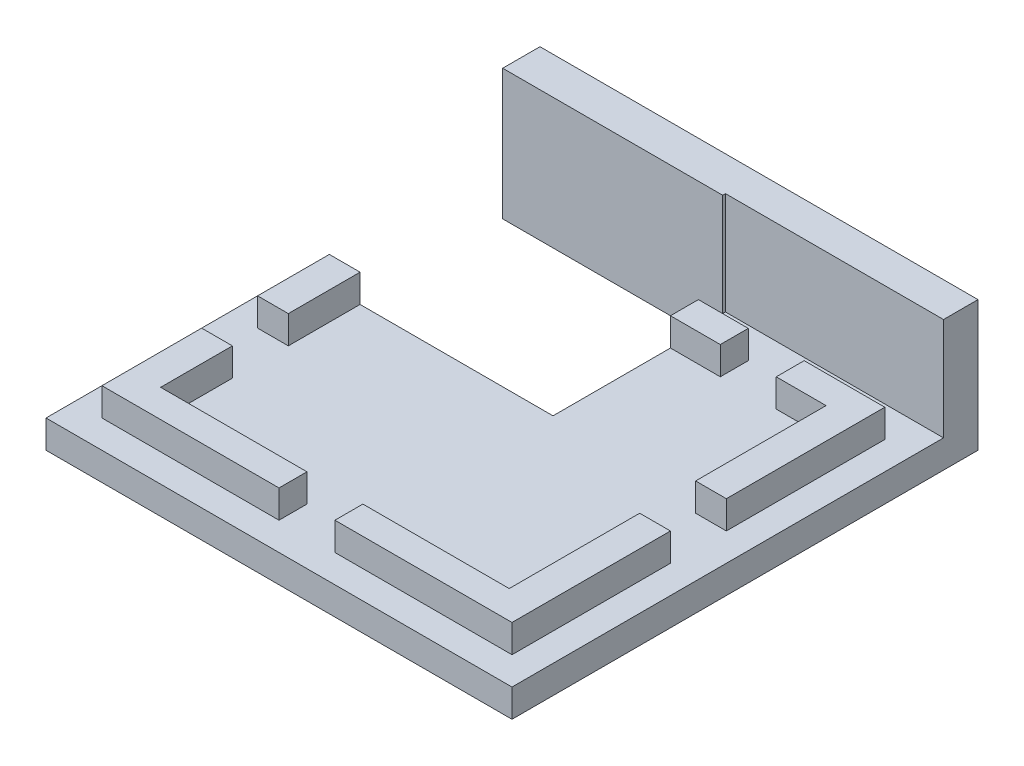
ISO-10303-21;
HEADER;
FILE_DESCRIPTION(('STEP AP214'),'2;1');
FILE_NAME('part.step','',(''),(''),'','','');
FILE_SCHEMA(('AUTOMOTIVE_DESIGN { 1 0 10303 214 1 1 1 1 }'));
ENDSEC;
DATA;
#1=APPLICATION_CONTEXT('core data for automotive mechanical design processes');
#2=APPLICATION_PROTOCOL_DEFINITION('international standard','automotive_design',2000,#1);
#3=PRODUCT_CONTEXT('',#1,'mechanical');
#4=PRODUCT('Part','Part','',(#3));
#5=PRODUCT_RELATED_PRODUCT_CATEGORY('part','',(#4));
#6=PRODUCT_DEFINITION_FORMATION('','',#4);
#7=PRODUCT_DEFINITION_CONTEXT('part definition',#1,'design');
#8=PRODUCT_DEFINITION('design','',#6,#7);
#9=PRODUCT_DEFINITION_SHAPE('','',#8);
#10=(LENGTH_UNIT() NAMED_UNIT(*) SI_UNIT(.MILLI.,.METRE.));
#11=(NAMED_UNIT(*) PLANE_ANGLE_UNIT() SI_UNIT($,.RADIAN.));
#12=(NAMED_UNIT(*) SI_UNIT($,.STERADIAN.) SOLID_ANGLE_UNIT());
#13=UNCERTAINTY_MEASURE_WITH_UNIT(LENGTH_MEASURE(1.E-05),#10,'distance_accuracy_value','');
#14=(GEOMETRIC_REPRESENTATION_CONTEXT(3) GLOBAL_UNCERTAINTY_ASSIGNED_CONTEXT((#13)) GLOBAL_UNIT_ASSIGNED_CONTEXT((#10,
#11,#12)) REPRESENTATION_CONTEXT('',''));
#15=CARTESIAN_POINT('',(0.,0.,0.));
#16=DIRECTION('',(0.,0.,1.));
#17=DIRECTION('',(1.,0.,0.));
#18=AXIS2_PLACEMENT_3D('',#15,#16,#17);
#19=CARTESIAN_POINT('',(-11.,3.,-10.));
#20=DIRECTION('',(0.,0.,1.));
#21=DIRECTION('',(1.,0.,0.));
#22=AXIS2_PLACEMENT_3D('',#19,#20,#21);
#23=PLANE('',#22);
#24=DIRECTION('',(-1.,0.,0.));
#25=VECTOR('',#24,1.);
#26=CARTESIAN_POINT('',(-11.,1.5,-10.));
#27=LINE('',#26,#25);
#28=CARTESIAN_POINT('',(11.,1.5,-10.));
#29=VERTEX_POINT('',#28);
#30=CARTESIAN_POINT('',(6.675,1.5,-10.));
#31=VERTEX_POINT('',#30);
#32=EDGE_CURVE('E497',#29,#31,#27,.T.);
#33=ORIENTED_EDGE('',*,*,#32,.T.);
#34=DIRECTION('',(0.,1.,0.));
#35=VECTOR('',#34,1.);
#36=CARTESIAN_POINT('',(6.675,-1.923813663154,-10.));
#37=LINE('',#36,#35);
#38=CARTESIAN_POINT('',(6.675,3.,-10.));
#39=VERTEX_POINT('',#38);
#40=EDGE_CURVE('E395',#31,#39,#37,.T.);
#41=ORIENTED_EDGE('',*,*,#40,.T.);
#42=DIRECTION('',(-1.,0.,0.));
#43=VECTOR('',#42,1.);
#44=CARTESIAN_POINT('',(-11.,3.,-10.));
#45=LINE('',#44,#43);
#46=CARTESIAN_POINT('',(11.,3.,-10.));
#47=VERTEX_POINT('',#46);
#48=EDGE_CURVE('E481',#47,#39,#45,.T.);
#49=ORIENTED_EDGE('',*,*,#48,.F.);
#50=DIRECTION('',(0.,-1.,0.));
#51=VECTOR('',#50,1.);
#52=CARTESIAN_POINT('',(11.,3.,-10.));
#53=LINE('',#52,#51);
#54=EDGE_CURVE('E513',#47,#29,#53,.T.);
#55=ORIENTED_EDGE('',*,*,#54,.T.);
#56=EDGE_LOOP('',(#33,#41,#49,#55));
#57=FACE_BOUND('',#56,.T.);
#58=ADVANCED_FACE('F33',(#57),#23,.F.);
#59=CARTESIAN_POINT('',(-9.35,3.,-8.5));
#60=DIRECTION('',(0.,0.,1.));
#61=DIRECTION('',(1.,0.,0.));
#62=AXIS2_PLACEMENT_3D('',#59,#60,#61);
#63=PLANE('',#62);
#64=DIRECTION('',(0.,1.,0.));
#65=VECTOR('',#64,1.);
#66=CARTESIAN_POINT('',(6.675,-1.923813663154,-8.5));
#67=LINE('',#66,#65);
#68=CARTESIAN_POINT('',(6.675,1.5,-8.5));
#69=VERTEX_POINT('',#68);
#70=CARTESIAN_POINT('',(6.675,3.,-8.5));
#71=VERTEX_POINT('',#70);
#72=EDGE_CURVE('E387',#69,#71,#67,.T.);
#73=ORIENTED_EDGE('',*,*,#72,.F.);
#74=DIRECTION('',(-1.,0.,0.));
#75=VECTOR('',#74,1.);
#76=CARTESIAN_POINT('',(-9.35,1.5,-8.5));
#77=LINE('',#76,#75);
#78=CARTESIAN_POINT('',(9.35,1.5,-8.5));
#79=VERTEX_POINT('',#78);
#80=EDGE_CURVE('E456',#79,#69,#77,.T.);
#81=ORIENTED_EDGE('',*,*,#80,.F.);
#82=DIRECTION('',(0.,-1.,0.));
#83=VECTOR('',#82,1.);
#84=CARTESIAN_POINT('',(9.35,3.,-8.5));
#85=LINE('',#84,#83);
#86=CARTESIAN_POINT('',(9.35,3.,-8.5));
#87=VERTEX_POINT('',#86);
#88=EDGE_CURVE('E472',#87,#79,#85,.T.);
#89=ORIENTED_EDGE('',*,*,#88,.F.);
#90=DIRECTION('',(-1.,0.,0.));
#91=VECTOR('',#90,1.);
#92=CARTESIAN_POINT('',(-9.35,3.,-8.5));
#93=LINE('',#92,#91);
#94=EDGE_CURVE('E440',#87,#71,#93,.T.);
#95=ORIENTED_EDGE('',*,*,#94,.T.);
#96=EDGE_LOOP('',(#73,#81,#89,#95));
#97=FACE_BOUND('',#96,.T.);
#98=ADVANCED_FACE('F603',(#97),#63,.T.);
#99=CARTESIAN_POINT('',(0.,3.,0.));
#100=DIRECTION('',(0.,-1.,0.));
#101=DIRECTION('',(0.,0.,-1.));
#102=AXIS2_PLACEMENT_3D('',#99,#100,#101);
#103=PLANE('',#102);
#104=DIRECTION('',(0.,0.,1.));
#105=VECTOR('',#104,1.);
#106=CARTESIAN_POINT('',(-9.35,3.,8.5));
#107=LINE('',#106,#105);
#108=CARTESIAN_POINT('',(-9.35,3.,4.65));
#109=VERTEX_POINT('',#108);
#110=CARTESIAN_POINT('',(-9.35,3.,8.5));
#111=VERTEX_POINT('',#110);
#112=EDGE_CURVE('E443',#109,#111,#107,.T.);
#113=ORIENTED_EDGE('',*,*,#112,.F.);
#114=DIRECTION('',(1.,0.,0.));
#115=VECTOR('',#114,1.);
#116=CARTESIAN_POINT('',(-11.,3.,4.65));
#117=LINE('',#116,#115);
#118=CARTESIAN_POINT('',(-11.,3.,4.65));
#119=VERTEX_POINT('',#118);
#120=EDGE_CURVE('E331',#119,#109,#117,.T.);
#121=ORIENTED_EDGE('',*,*,#120,.F.);
#122=DIRECTION('',(0.,0.,1.));
#123=VECTOR('',#122,1.);
#124=CARTESIAN_POINT('',(-11.,3.,10.));
#125=LINE('',#124,#123);
#126=CARTESIAN_POINT('',(-11.,3.,10.));
#127=VERTEX_POINT('',#126);
#128=EDGE_CURVE('E484',#119,#127,#125,.T.);
#129=ORIENTED_EDGE('',*,*,#128,.T.);
#130=DIRECTION('',(1.,0.,0.));
#131=VECTOR('',#130,1.);
#132=CARTESIAN_POINT('',(-11.,3.,10.));
#133=LINE('',#132,#131);
#134=CARTESIAN_POINT('',(-1.5,3.,10.));
#135=VERTEX_POINT('',#134);
#136=EDGE_CURVE('E489',#127,#135,#133,.T.);
#137=ORIENTED_EDGE('',*,*,#136,.T.);
#138=DIRECTION('',(0.,0.,1.));
#139=VECTOR('',#138,1.);
#140=CARTESIAN_POINT('',(-1.5,3.,8.5));
#141=LINE('',#140,#139);
#142=CARTESIAN_POINT('',(-1.5,3.,8.5));
#143=VERTEX_POINT('',#142);
#144=EDGE_CURVE('E352',#143,#135,#141,.T.);
#145=ORIENTED_EDGE('',*,*,#144,.F.);
#146=DIRECTION('',(1.,0.,0.));
#147=VECTOR('',#146,1.);
#148=CARTESIAN_POINT('',(-9.35,3.,8.5));
#149=LINE('',#148,#147);
#150=EDGE_CURVE('E448',#111,#143,#149,.T.);
#151=ORIENTED_EDGE('',*,*,#150,.F.);
#152=EDGE_LOOP('',(#113,#121,#129,#137,#145,#151));
#153=FACE_BOUND('',#152,.T.);
#154=ADVANCED_FACE('F609',(#153),#103,.F.);
#155=CARTESIAN_POINT('',(1.5,3.,8.5));
#156=VERTEX_POINT('',#155);
#157=CARTESIAN_POINT('',(9.35,3.,8.5));
#158=VERTEX_POINT('',#157);
#159=EDGE_CURVE('E447',#156,#158,#149,.T.);
#160=ORIENTED_EDGE('',*,*,#159,.F.);
#161=DIRECTION('',(0.,0.,-1.));
#162=VECTOR('',#161,1.);
#163=CARTESIAN_POINT('',(1.5,3.,8.5));
#164=LINE('',#163,#162);
#165=CARTESIAN_POINT('',(1.5,3.,10.));
#166=VERTEX_POINT('',#165);
#167=EDGE_CURVE('E349',#166,#156,#164,.T.);
#168=ORIENTED_EDGE('',*,*,#167,.F.);
#169=CARTESIAN_POINT('',(11.,3.,10.));
#170=VERTEX_POINT('',#169);
#171=EDGE_CURVE('E488',#166,#170,#133,.T.);
#172=ORIENTED_EDGE('',*,*,#171,.T.);
#173=DIRECTION('',(0.,0.,-1.));
#174=VECTOR('',#173,1.);
#175=CARTESIAN_POINT('',(11.,3.,10.));
#176=LINE('',#175,#174);
#177=CARTESIAN_POINT('',(11.,3.,1.5));
#178=VERTEX_POINT('',#177);
#179=EDGE_CURVE('E476',#170,#178,#176,.T.);
#180=ORIENTED_EDGE('',*,*,#179,.T.);
#181=DIRECTION('',(1.,0.,0.));
#182=VECTOR('',#181,1.);
#183=CARTESIAN_POINT('',(9.35,3.,1.5));
#184=LINE('',#183,#182);
#185=CARTESIAN_POINT('',(9.35,3.,1.5));
#186=VERTEX_POINT('',#185);
#187=EDGE_CURVE('E370',#186,#178,#184,.T.);
#188=ORIENTED_EDGE('',*,*,#187,.F.);
#189=DIRECTION('',(0.,0.,-1.));
#190=VECTOR('',#189,1.);
#191=CARTESIAN_POINT('',(9.35,3.,8.5));
#192=LINE('',#191,#190);
#193=EDGE_CURVE('E435',#158,#186,#192,.T.);
#194=ORIENTED_EDGE('',*,*,#193,.F.);
#195=EDGE_LOOP('',(#160,#168,#172,#180,#188,#194));
#196=FACE_BOUND('',#195,.T.);
#197=ADVANCED_FACE('F950',(#196),#103,.F.);
#198=CARTESIAN_POINT('',(-11.,3.,-2.2));
#199=VERTEX_POINT('',#198);
#200=CARTESIAN_POINT('',(-11.,3.,1.65));
#201=VERTEX_POINT('',#200);
#202=EDGE_CURVE('E485',#199,#201,#125,.T.);
#203=ORIENTED_EDGE('',*,*,#202,.T.);
#204=DIRECTION('',(-1.,0.,0.));
#205=VECTOR('',#204,1.);
#206=CARTESIAN_POINT('',(-11.,3.,1.65));
#207=LINE('',#206,#205);
#208=CARTESIAN_POINT('',(-9.35,3.,1.65));
#209=VERTEX_POINT('',#208);
#210=EDGE_CURVE('E328',#209,#201,#207,.T.);
#211=ORIENTED_EDGE('',*,*,#210,.F.);
#212=CARTESIAN_POINT('',(-9.35,3.,-2.2));
#213=VERTEX_POINT('',#212);
#214=EDGE_CURVE('E444',#213,#209,#107,.T.);
#215=ORIENTED_EDGE('',*,*,#214,.F.);
#216=DIRECTION('',(1.,0.,0.));
#217=VECTOR('',#216,1.);
#218=CARTESIAN_POINT('',(-11.,3.,-2.2));
#219=LINE('',#218,#217);
#220=EDGE_CURVE('E412',#199,#213,#219,.T.);
#221=ORIENTED_EDGE('',*,*,#220,.F.);
#222=EDGE_LOOP('',(#203,#211,#215,#221));
#223=FACE_BOUND('',#222,.T.);
#224=ADVANCED_FACE('F580',(#223),#103,.F.);
#225=CARTESIAN_POINT('',(9.35,3.,-1.5));
#226=VERTEX_POINT('',#225);
#227=EDGE_CURVE('E439',#226,#87,#192,.T.);
#228=ORIENTED_EDGE('',*,*,#227,.F.);
#229=DIRECTION('',(-1.,0.,0.));
#230=VECTOR('',#229,1.);
#231=CARTESIAN_POINT('',(9.35,3.,-1.5));
#232=LINE('',#231,#230);
#233=CARTESIAN_POINT('',(11.,3.,-1.5));
#234=VERTEX_POINT('',#233);
#235=EDGE_CURVE('E367',#234,#226,#232,.T.);
#236=ORIENTED_EDGE('',*,*,#235,.F.);
#237=EDGE_CURVE('E480',#234,#47,#176,.T.);
#238=ORIENTED_EDGE('',*,*,#237,.T.);
#239=ORIENTED_EDGE('',*,*,#48,.T.);
#240=DIRECTION('',(0.,0.,-1.));
#241=VECTOR('',#240,1.);
#242=CARTESIAN_POINT('',(6.675,3.,-10.));
#243=LINE('',#242,#241);
#244=EDGE_CURVE('E385',#71,#39,#243,.T.);
#245=ORIENTED_EDGE('',*,*,#244,.F.);
#246=ORIENTED_EDGE('',*,*,#94,.F.);
#247=EDGE_LOOP('',(#228,#236,#238,#239,#245,#246));
#248=FACE_BOUND('',#247,.T.);
#249=ADVANCED_FACE('F672',(#248),#103,.F.);
#250=CARTESIAN_POINT('',(11.,3.,10.));
#251=DIRECTION('',(-1.,0.,0.));
#252=DIRECTION('',(0.,0.,1.));
#253=AXIS2_PLACEMENT_3D('',#250,#251,#252);
#254=PLANE('',#253);
#255=DIRECTION('',(0.,0.,-1.));
#256=VECTOR('',#255,1.);
#257=CARTESIAN_POINT('',(11.,1.5,10.));
#258=LINE('',#257,#256);
#259=CARTESIAN_POINT('',(11.,1.5,10.));
#260=VERTEX_POINT('',#259);
#261=CARTESIAN_POINT('',(11.,1.5,1.5));
#262=VERTEX_POINT('',#261);
#263=EDGE_CURVE('E493',#260,#262,#258,.T.);
#264=ORIENTED_EDGE('',*,*,#263,.T.);
#265=DIRECTION('',(0.,1.,0.));
#266=VECTOR('',#265,1.);
#267=CARTESIAN_POINT('',(11.,-1.923813663154,1.5));
#268=LINE('',#267,#266);
#269=EDGE_CURVE('E374',#262,#178,#268,.T.);
#270=ORIENTED_EDGE('',*,*,#269,.T.);
#271=ORIENTED_EDGE('',*,*,#179,.F.);
#272=DIRECTION('',(0.,-1.,0.));
#273=VECTOR('',#272,1.);
#274=CARTESIAN_POINT('',(11.,3.,10.));
#275=LINE('',#274,#273);
#276=EDGE_CURVE('E492',#170,#260,#275,.T.);
#277=ORIENTED_EDGE('',*,*,#276,.T.);
#278=EDGE_LOOP('',(#264,#270,#271,#277));
#279=FACE_BOUND('',#278,.T.);
#280=ADVANCED_FACE('F665',(#279),#254,.F.);
#281=CARTESIAN_POINT('',(-11.,3.,10.));
#282=DIRECTION('',(1.,0.,0.));
#283=DIRECTION('',(0.,0.,-1.));
#284=AXIS2_PLACEMENT_3D('',#281,#282,#283);
#285=PLANE('',#284);
#286=ORIENTED_EDGE('',*,*,#128,.F.);
#287=DIRECTION('',(0.,1.,0.));
#288=VECTOR('',#287,1.);
#289=CARTESIAN_POINT('',(-11.,-1.923813663154,4.65));
#290=LINE('',#289,#288);
#291=CARTESIAN_POINT('',(-11.,1.5,4.65));
#292=VERTEX_POINT('',#291);
#293=EDGE_CURVE('E343',#292,#119,#290,.T.);
#294=ORIENTED_EDGE('',*,*,#293,.F.);
#295=DIRECTION('',(0.,0.,1.));
#296=VECTOR('',#295,1.);
#297=CARTESIAN_POINT('',(-11.,1.5,10.));
#298=LINE('',#297,#296);
#299=CARTESIAN_POINT('',(-11.,1.5,10.));
#300=VERTEX_POINT('',#299);
#301=EDGE_CURVE('E500',#292,#300,#298,.T.);
#302=ORIENTED_EDGE('',*,*,#301,.T.);
#303=DIRECTION('',(0.,-1.,0.));
#304=VECTOR('',#303,1.);
#305=CARTESIAN_POINT('',(-11.,3.,10.));
#306=LINE('',#305,#304);
#307=EDGE_CURVE('E510',#127,#300,#306,.T.);
#308=ORIENTED_EDGE('',*,*,#307,.F.);
#309=EDGE_LOOP('',(#286,#294,#302,#308));
#310=FACE_BOUND('',#309,.T.);
#311=ADVANCED_FACE('F662',(#310),#285,.F.);
#312=CARTESIAN_POINT('',(-11.,3.,10.));
#313=DIRECTION('',(0.,0.,-1.));
#314=DIRECTION('',(-1.,0.,0.));
#315=AXIS2_PLACEMENT_3D('',#312,#313,#314);
#316=PLANE('',#315);
#317=ORIENTED_EDGE('',*,*,#171,.F.);
#318=DIRECTION('',(0.,1.,0.));
#319=VECTOR('',#318,1.);
#320=CARTESIAN_POINT('',(1.5,-1.923813663154,10.));
#321=LINE('',#320,#319);
#322=CARTESIAN_POINT('',(1.5,1.5,10.));
#323=VERTEX_POINT('',#322);
#324=EDGE_CURVE('E351',#323,#166,#321,.T.);
#325=ORIENTED_EDGE('',*,*,#324,.F.);
#326=DIRECTION('',(1.,0.,0.));
#327=VECTOR('',#326,1.);
#328=CARTESIAN_POINT('',(-11.,1.5,10.));
#329=LINE('',#328,#327);
#330=EDGE_CURVE('E504',#323,#260,#329,.T.);
#331=ORIENTED_EDGE('',*,*,#330,.T.);
#332=ORIENTED_EDGE('',*,*,#276,.F.);
#333=EDGE_LOOP('',(#317,#325,#331,#332));
#334=FACE_BOUND('',#333,.T.);
#335=ADVANCED_FACE('F664',(#334),#316,.F.);
#336=CARTESIAN_POINT('',(9.35,3.,8.5));
#337=DIRECTION('',(-1.,0.,0.));
#338=DIRECTION('',(0.,0.,1.));
#339=AXIS2_PLACEMENT_3D('',#336,#337,#338);
#340=PLANE('',#339);
#341=DIRECTION('',(0.,1.,0.));
#342=VECTOR('',#341,1.);
#343=CARTESIAN_POINT('',(9.35,-1.923813663154,1.5));
#344=LINE('',#343,#342);
#345=CARTESIAN_POINT('',(9.35,1.5,1.5));
#346=VERTEX_POINT('',#345);
#347=EDGE_CURVE('E354',#346,#186,#344,.T.);
#348=ORIENTED_EDGE('',*,*,#347,.F.);
#349=DIRECTION('',(0.,0.,-1.));
#350=VECTOR('',#349,1.);
#351=CARTESIAN_POINT('',(9.35,1.5,8.5));
#352=LINE('',#351,#350);
#353=CARTESIAN_POINT('',(9.35,1.5,8.5));
#354=VERTEX_POINT('',#353);
#355=EDGE_CURVE('E452',#354,#346,#352,.T.);
#356=ORIENTED_EDGE('',*,*,#355,.F.);
#357=DIRECTION('',(0.,-1.,0.));
#358=VECTOR('',#357,1.);
#359=CARTESIAN_POINT('',(9.35,3.,8.5));
#360=LINE('',#359,#358);
#361=EDGE_CURVE('E451',#158,#354,#360,.T.);
#362=ORIENTED_EDGE('',*,*,#361,.F.);
#363=ORIENTED_EDGE('',*,*,#193,.T.);
#364=EDGE_LOOP('',(#348,#356,#362,#363));
#365=FACE_BOUND('',#364,.T.);
#366=ADVANCED_FACE('F627',(#365),#340,.T.);
#367=CARTESIAN_POINT('',(-9.35,3.,8.5));
#368=DIRECTION('',(1.,0.,0.));
#369=DIRECTION('',(0.,0.,-1.));
#370=AXIS2_PLACEMENT_3D('',#367,#368,#369);
#371=PLANE('',#370);
#372=DIRECTION('',(0.,1.,0.));
#373=VECTOR('',#372,1.);
#374=CARTESIAN_POINT('',(-9.35,-1.923813663154,4.65));
#375=LINE('',#374,#373);
#376=CARTESIAN_POINT('',(-9.35,1.5,4.65));
#377=VERTEX_POINT('',#376);
#378=EDGE_CURVE('E335',#377,#109,#375,.T.);
#379=ORIENTED_EDGE('',*,*,#378,.T.);
#380=ORIENTED_EDGE('',*,*,#112,.T.);
#381=DIRECTION('',(0.,-1.,0.));
#382=VECTOR('',#381,1.);
#383=CARTESIAN_POINT('',(-9.35,3.,8.5));
#384=LINE('',#383,#382);
#385=CARTESIAN_POINT('',(-9.35,1.5,8.5));
#386=VERTEX_POINT('',#385);
#387=EDGE_CURVE('E469',#111,#386,#384,.T.);
#388=ORIENTED_EDGE('',*,*,#387,.T.);
#389=DIRECTION('',(0.,0.,1.));
#390=VECTOR('',#389,1.);
#391=CARTESIAN_POINT('',(-9.35,1.5,8.5));
#392=LINE('',#391,#390);
#393=EDGE_CURVE('E459',#377,#386,#392,.T.);
#394=ORIENTED_EDGE('',*,*,#393,.F.);
#395=EDGE_LOOP('',(#379,#380,#388,#394));
#396=FACE_BOUND('',#395,.T.);
#397=ADVANCED_FACE('F620',(#396),#371,.T.);
#398=CARTESIAN_POINT('',(-9.35,3.,8.5));
#399=DIRECTION('',(0.,0.,-1.));
#400=DIRECTION('',(-1.,0.,0.));
#401=AXIS2_PLACEMENT_3D('',#398,#399,#400);
#402=PLANE('',#401);
#403=DIRECTION('',(0.,1.,0.));
#404=VECTOR('',#403,1.);
#405=CARTESIAN_POINT('',(1.5,-1.923813663154,8.5));
#406=LINE('',#405,#404);
#407=CARTESIAN_POINT('',(1.5,1.5,8.5));
#408=VERTEX_POINT('',#407);
#409=EDGE_CURVE('E360',#408,#156,#406,.T.);
#410=ORIENTED_EDGE('',*,*,#409,.T.);
#411=ORIENTED_EDGE('',*,*,#159,.T.);
#412=ORIENTED_EDGE('',*,*,#361,.T.);
#413=DIRECTION('',(1.,0.,0.));
#414=VECTOR('',#413,1.);
#415=CARTESIAN_POINT('',(-9.35,1.5,8.5));
#416=LINE('',#415,#414);
#417=EDGE_CURVE('E463',#408,#354,#416,.T.);
#418=ORIENTED_EDGE('',*,*,#417,.F.);
#419=EDGE_LOOP('',(#410,#411,#412,#418));
#420=FACE_BOUND('',#419,.T.);
#421=ADVANCED_FACE('F615',(#420),#402,.T.);
#422=CARTESIAN_POINT('',(3.675,3.,-10.));
#423=VERTEX_POINT('',#422);
#424=CARTESIAN_POINT('',(0.999999999999993,3.,-10.));
#425=VERTEX_POINT('',#424);
#426=EDGE_CURVE('E479',#423,#425,#45,.T.);
#427=ORIENTED_EDGE('',*,*,#426,.F.);
#428=DIRECTION('',(0.,1.,0.));
#429=VECTOR('',#428,1.);
#430=CARTESIAN_POINT('',(3.675,-1.923813663154,-10.));
#431=LINE('',#430,#429);
#432=CARTESIAN_POINT('',(3.675,1.5,-10.));
#433=VERTEX_POINT('',#432);
#434=EDGE_CURVE('E391',#433,#423,#431,.T.);
#435=ORIENTED_EDGE('',*,*,#434,.F.);
#436=CARTESIAN_POINT('',(0.999999999999994,1.5,-10.));
#437=VERTEX_POINT('',#436);
#438=EDGE_CURVE('E496',#433,#437,#27,.T.);
#439=ORIENTED_EDGE('',*,*,#438,.T.);
#440=DIRECTION('',(0.,1.,0.));
#441=VECTOR('',#440,1.);
#442=CARTESIAN_POINT('',(0.999999999999993,0.,-10.));
#443=LINE('',#442,#441);
#444=EDGE_CURVE('E426',#437,#425,#443,.T.);
#445=ORIENTED_EDGE('',*,*,#444,.T.);
#446=EDGE_LOOP('',(#427,#435,#439,#445));
#447=FACE_BOUND('',#446,.T.);
#448=ADVANCED_FACE('F551',(#447),#23,.F.);
#449=DIRECTION('',(0.,1.,0.));
#450=VECTOR('',#449,1.);
#451=CARTESIAN_POINT('',(3.675,-1.923813663154,-8.5));
#452=LINE('',#451,#450);
#453=CARTESIAN_POINT('',(3.675,1.5,-8.5));
#454=VERTEX_POINT('',#453);
#455=CARTESIAN_POINT('',(3.675,3.,-8.5));
#456=VERTEX_POINT('',#455);
#457=EDGE_CURVE('E56',#454,#456,#452,.T.);
#458=ORIENTED_EDGE('',*,*,#457,.T.);
#459=CARTESIAN_POINT('',(0.999999999999993,3.,-8.5));
#460=VERTEX_POINT('',#459);
#461=EDGE_CURVE('E438',#456,#460,#93,.T.);
#462=ORIENTED_EDGE('',*,*,#461,.T.);
#463=DIRECTION('',(0.,-1.,0.));
#464=VECTOR('',#463,1.);
#465=CARTESIAN_POINT('',(0.999999999999992,3.,-8.5));
#466=LINE('',#465,#464);
#467=CARTESIAN_POINT('',(0.999999999999993,1.5,-8.5));
#468=VERTEX_POINT('',#467);
#469=EDGE_CURVE('E425',#460,#468,#466,.T.);
#470=ORIENTED_EDGE('',*,*,#469,.T.);
#471=EDGE_CURVE('E455',#454,#468,#77,.T.);
#472=ORIENTED_EDGE('',*,*,#471,.F.);
#473=EDGE_LOOP('',(#458,#462,#470,#472));
#474=FACE_BOUND('',#473,.T.);
#475=ADVANCED_FACE('F542',(#474),#63,.T.);
#476=CARTESIAN_POINT('',(12.5,1.5,11.5));
#477=DIRECTION('',(-1.,0.,0.));
#478=DIRECTION('',(0.,0.,1.));
#479=AXIS2_PLACEMENT_3D('',#476,#477,#478);
#480=PLANE('',#479);
#481=DIRECTION('',(0.,1.,0.));
#482=VECTOR('',#481,1.);
#483=CARTESIAN_POINT('',(12.5,-10.2009614989538,-11.65));
#484=LINE('',#483,#482);
#485=CARTESIAN_POINT('',(12.5,1.5,-11.65));
#486=VERTEX_POINT('',#485);
#487=CARTESIAN_POINT('',(12.5,7.,-11.65));
#488=VERTEX_POINT('',#487);
#489=EDGE_CURVE('E298',#486,#488,#484,.T.);
#490=ORIENTED_EDGE('',*,*,#489,.F.);
#491=DIRECTION('',(0.,0.,-1.));
#492=VECTOR('',#491,1.);
#493=CARTESIAN_POINT('',(12.5,1.5,11.5));
#494=LINE('',#493,#492);
#495=CARTESIAN_POINT('',(12.5,1.5,11.5));
#496=VERTEX_POINT('',#495);
#497=EDGE_CURVE('E291',#496,#486,#494,.T.);
#498=ORIENTED_EDGE('',*,*,#497,.F.);
#499=DIRECTION('',(0.,-1.,0.));
#500=VECTOR('',#499,1.);
#501=CARTESIAN_POINT('',(12.5,1.5,11.5));
#502=LINE('',#501,#500);
#503=CARTESIAN_POINT('',(12.5,0.,11.5));
#504=VERTEX_POINT('',#503);
#505=EDGE_CURVE('E523',#496,#504,#502,.T.);
#506=ORIENTED_EDGE('',*,*,#505,.T.);
#507=DIRECTION('',(0.,0.,-1.));
#508=VECTOR('',#507,1.);
#509=CARTESIAN_POINT('',(12.5,0.,11.5));
#510=LINE('',#509,#508);
#511=CARTESIAN_POINT('',(12.5,0.,-13.5));
#512=VERTEX_POINT('',#511);
#513=EDGE_CURVE('E516',#504,#512,#510,.T.);
#514=ORIENTED_EDGE('',*,*,#513,.T.);
#515=DIRECTION('',(0.,-1.,0.));
#516=VECTOR('',#515,1.);
#517=CARTESIAN_POINT('',(12.5,0.,-13.5));
#518=LINE('',#517,#516);
#519=CARTESIAN_POINT('',(12.5,7.,-13.5));
#520=VERTEX_POINT('',#519);
#521=EDGE_CURVE('E303',#520,#512,#518,.T.);
#522=ORIENTED_EDGE('',*,*,#521,.F.);
#523=DIRECTION('',(0.,0.,1.));
#524=VECTOR('',#523,1.);
#525=CARTESIAN_POINT('',(12.5,7.,-13.5));
#526=LINE('',#525,#524);
#527=EDGE_CURVE('E313',#520,#488,#526,.T.);
#528=ORIENTED_EDGE('',*,*,#527,.T.);
#529=EDGE_LOOP('',(#490,#498,#506,#514,#522,#528));
#530=FACE_BOUND('',#529,.T.);
#531=ADVANCED_FACE('F35',(#530),#480,.F.);
#532=CARTESIAN_POINT('',(-12.5,1.5,11.5));
#533=DIRECTION('',(1.,0.,0.));
#534=DIRECTION('',(0.,0.,-1.));
#535=AXIS2_PLACEMENT_3D('',#532,#533,#534);
#536=PLANE('',#535);
#537=DIRECTION('',(0.,0.,1.));
#538=VECTOR('',#537,1.);
#539=CARTESIAN_POINT('',(-12.5,1.5,11.5));
#540=LINE('',#539,#538);
#541=CARTESIAN_POINT('',(-12.5,1.5,-2.2));
#542=VERTEX_POINT('',#541);
#543=CARTESIAN_POINT('',(-12.5,1.5,11.5));
#544=VERTEX_POINT('',#543);
#545=EDGE_CURVE('E518',#542,#544,#540,.T.);
#546=ORIENTED_EDGE('',*,*,#545,.F.);
#547=DIRECTION('',(0.,-1.,0.));
#548=VECTOR('',#547,1.);
#549=CARTESIAN_POINT('',(-12.5,3.,-2.2));
#550=LINE('',#549,#548);
#551=CARTESIAN_POINT('',(-12.5,0.,-2.2));
#552=VERTEX_POINT('',#551);
#553=EDGE_CURVE('E348',#542,#552,#550,.T.);
#554=ORIENTED_EDGE('',*,*,#553,.T.);
#555=DIRECTION('',(0.,0.,1.));
#556=VECTOR('',#555,1.);
#557=CARTESIAN_POINT('',(-12.5,0.,11.5));
#558=LINE('',#557,#556);
#559=CARTESIAN_POINT('',(-12.5,0.,11.5));
#560=VERTEX_POINT('',#559);
#561=EDGE_CURVE('E525',#552,#560,#558,.T.);
#562=ORIENTED_EDGE('',*,*,#561,.T.);
#563=DIRECTION('',(0.,-1.,0.));
#564=VECTOR('',#563,1.);
#565=CARTESIAN_POINT('',(-12.5,1.5,11.5));
#566=LINE('',#565,#564);
#567=EDGE_CURVE('E530',#544,#560,#566,.T.);
#568=ORIENTED_EDGE('',*,*,#567,.F.);
#569=EDGE_LOOP('',(#546,#554,#562,#568));
#570=FACE_BOUND('',#569,.T.);
#571=ADVANCED_FACE('F568',(#570),#536,.F.);
#572=CARTESIAN_POINT('',(-12.5,1.5,11.5));
#573=DIRECTION('',(0.,0.,-1.));
#574=DIRECTION('',(-1.,0.,0.));
#575=AXIS2_PLACEMENT_3D('',#572,#573,#574);
#576=PLANE('',#575);
#577=DIRECTION('',(1.,0.,0.));
#578=VECTOR('',#577,1.);
#579=CARTESIAN_POINT('',(-12.5,0.,11.5));
#580=LINE('',#579,#578);
#581=EDGE_CURVE('E519',#560,#504,#580,.T.);
#582=ORIENTED_EDGE('',*,*,#581,.T.);
#583=ORIENTED_EDGE('',*,*,#505,.F.);
#584=DIRECTION('',(1.,0.,0.));
#585=VECTOR('',#584,1.);
#586=CARTESIAN_POINT('',(-12.5,1.5,11.5));
#587=LINE('',#586,#585);
#588=EDGE_CURVE('E521',#544,#496,#587,.T.);
#589=ORIENTED_EDGE('',*,*,#588,.F.);
#590=ORIENTED_EDGE('',*,*,#567,.T.);
#591=EDGE_LOOP('',(#582,#583,#589,#590));
#592=FACE_BOUND('',#591,.T.);
#593=ADVANCED_FACE('F689',(#592),#576,.F.);
#594=CARTESIAN_POINT('',(0.,0.,0.));
#595=DIRECTION('',(0.,-1.,0.));
#596=DIRECTION('',(0.,0.,-1.));
#597=AXIS2_PLACEMENT_3D('',#594,#595,#596);
#598=PLANE('',#597);
#599=DIRECTION('',(0.,0.,1.));
#600=VECTOR('',#599,1.);
#601=CARTESIAN_POINT('',(0.999999999999993,0.,-10.));
#602=LINE('',#601,#600);
#603=CARTESIAN_POINT('',(0.999999999999994,0.,-11.5));
#604=VERTEX_POINT('',#603);
#605=CARTESIAN_POINT('',(0.999999999999994,0.,-2.2));
#606=VERTEX_POINT('',#605);
#607=EDGE_CURVE('E420',#604,#606,#602,.T.);
#608=ORIENTED_EDGE('',*,*,#607,.F.);
#609=DIRECTION('',(-1.,0.,0.));
#610=VECTOR('',#609,1.);
#611=CARTESIAN_POINT('',(12.5,0.,-11.5));
#612=LINE('',#611,#610);
#613=CARTESIAN_POINT('',(-11.,0.,-11.5));
#614=VERTEX_POINT('',#613);
#615=EDGE_CURVE('E302',#604,#614,#612,.T.);
#616=ORIENTED_EDGE('',*,*,#615,.T.);
#617=DIRECTION('',(0.,0.,1.));
#618=VECTOR('',#617,1.);
#619=CARTESIAN_POINT('',(-11.,0.,-13.5));
#620=LINE('',#619,#618);
#621=CARTESIAN_POINT('',(-11.,0.,-13.5));
#622=VERTEX_POINT('',#621);
#623=EDGE_CURVE('E324',#622,#614,#620,.T.);
#624=ORIENTED_EDGE('',*,*,#623,.F.);
#625=DIRECTION('',(-1.,0.,0.));
#626=VECTOR('',#625,1.);
#627=CARTESIAN_POINT('',(12.5,0.,-13.5));
#628=LINE('',#627,#626);
#629=EDGE_CURVE('E306',#512,#622,#628,.T.);
#630=ORIENTED_EDGE('',*,*,#629,.F.);
#631=ORIENTED_EDGE('',*,*,#513,.F.);
#632=ORIENTED_EDGE('',*,*,#581,.F.);
#633=ORIENTED_EDGE('',*,*,#561,.F.);
#634=DIRECTION('',(1.,0.,0.));
#635=VECTOR('',#634,1.);
#636=CARTESIAN_POINT('',(-11.,0.,-2.2));
#637=LINE('',#636,#635);
#638=EDGE_CURVE('E417',#552,#606,#637,.T.);
#639=ORIENTED_EDGE('',*,*,#638,.T.);
#640=EDGE_LOOP('',(#608,#616,#624,#630,#631,#632,#633,#639));
#641=FACE_BOUND('',#640,.T.);
#642=ADVANCED_FACE('F561',(#641),#598,.T.);
#643=ORIENTED_EDGE('',*,*,#461,.F.);
#644=DIRECTION('',(0.,0.,1.));
#645=VECTOR('',#644,1.);
#646=CARTESIAN_POINT('',(3.675,3.,-10.));
#647=LINE('',#646,#645);
#648=EDGE_CURVE('E327',#423,#456,#647,.T.);
#649=ORIENTED_EDGE('',*,*,#648,.F.);
#650=ORIENTED_EDGE('',*,*,#426,.T.);
#651=DIRECTION('',(0.,0.,1.));
#652=VECTOR('',#651,1.);
#653=CARTESIAN_POINT('',(0.999999999999993,3.,-10.));
#654=LINE('',#653,#652);
#655=EDGE_CURVE('E414',#425,#460,#654,.T.);
#656=ORIENTED_EDGE('',*,*,#655,.T.);
#657=EDGE_LOOP('',(#643,#649,#650,#656));
#658=FACE_BOUND('',#657,.T.);
#659=ADVANCED_FACE('F546',(#658),#103,.F.);
#660=ORIENTED_EDGE('',*,*,#237,.F.);
#661=DIRECTION('',(0.,1.,0.));
#662=VECTOR('',#661,1.);
#663=CARTESIAN_POINT('',(11.,-1.923813663154,-1.5));
#664=LINE('',#663,#662);
#665=CARTESIAN_POINT('',(11.,1.5,-1.5));
#666=VERTEX_POINT('',#665);
#667=EDGE_CURVE('E378',#666,#234,#664,.T.);
#668=ORIENTED_EDGE('',*,*,#667,.F.);
#669=EDGE_CURVE('E475',#666,#29,#258,.T.);
#670=ORIENTED_EDGE('',*,*,#669,.T.);
#671=ORIENTED_EDGE('',*,*,#54,.F.);
#672=EDGE_LOOP('',(#660,#668,#670,#671));
#673=FACE_BOUND('',#672,.T.);
#674=ADVANCED_FACE('F674',(#673),#254,.F.);
#675=CARTESIAN_POINT('',(-11.,1.5,-2.2));
#676=VERTEX_POINT('',#675);
#677=CARTESIAN_POINT('',(-11.,1.5,1.65));
#678=VERTEX_POINT('',#677);
#679=EDGE_CURVE('E501',#676,#678,#298,.T.);
#680=ORIENTED_EDGE('',*,*,#679,.T.);
#681=DIRECTION('',(0.,1.,0.));
#682=VECTOR('',#681,1.);
#683=CARTESIAN_POINT('',(-11.,-1.923813663154,1.65));
#684=LINE('',#683,#682);
#685=EDGE_CURVE('E339',#678,#201,#684,.T.);
#686=ORIENTED_EDGE('',*,*,#685,.T.);
#687=ORIENTED_EDGE('',*,*,#202,.F.);
#688=DIRECTION('',(0.,1.,0.));
#689=VECTOR('',#688,1.);
#690=CARTESIAN_POINT('',(-11.,0.,-2.2));
#691=LINE('',#690,#689);
#692=EDGE_CURVE('E423',#676,#199,#691,.T.);
#693=ORIENTED_EDGE('',*,*,#692,.F.);
#694=EDGE_LOOP('',(#680,#686,#687,#693));
#695=FACE_BOUND('',#694,.T.);
#696=ADVANCED_FACE('F577',(#695),#285,.F.);
#697=CARTESIAN_POINT('',(-1.5,1.5,10.));
#698=VERTEX_POINT('',#697);
#699=EDGE_CURVE('E505',#300,#698,#329,.T.);
#700=ORIENTED_EDGE('',*,*,#699,.T.);
#701=DIRECTION('',(0.,1.,0.));
#702=VECTOR('',#701,1.);
#703=CARTESIAN_POINT('',(-1.5,-1.923813663154,10.));
#704=LINE('',#703,#702);
#705=EDGE_CURVE('E333',#698,#135,#704,.T.);
#706=ORIENTED_EDGE('',*,*,#705,.T.);
#707=ORIENTED_EDGE('',*,*,#136,.F.);
#708=ORIENTED_EDGE('',*,*,#307,.T.);
#709=EDGE_LOOP('',(#700,#706,#707,#708));
#710=FACE_BOUND('',#709,.T.);
#711=ADVANCED_FACE('F657',(#710),#316,.F.);
#712=DIRECTION('',(0.,1.,0.));
#713=VECTOR('',#712,1.);
#714=CARTESIAN_POINT('',(9.35,-1.923813663154,-1.5));
#715=LINE('',#714,#713);
#716=CARTESIAN_POINT('',(9.35,1.5,-1.5));
#717=VERTEX_POINT('',#716);
#718=EDGE_CURVE('E377',#717,#226,#715,.T.);
#719=ORIENTED_EDGE('',*,*,#718,.T.);
#720=ORIENTED_EDGE('',*,*,#227,.T.);
#721=ORIENTED_EDGE('',*,*,#88,.T.);
#722=EDGE_CURVE('E434',#717,#79,#352,.T.);
#723=ORIENTED_EDGE('',*,*,#722,.F.);
#724=EDGE_LOOP('',(#719,#720,#721,#723));
#725=FACE_BOUND('',#724,.T.);
#726=ADVANCED_FACE('F638',(#725),#340,.T.);
#727=DIRECTION('',(0.,1.,0.));
#728=VECTOR('',#727,1.);
#729=CARTESIAN_POINT('',(-9.35,-1.923813663154,1.65));
#730=LINE('',#729,#728);
#731=CARTESIAN_POINT('',(-9.35,1.5,1.65));
#732=VERTEX_POINT('',#731);
#733=EDGE_CURVE('E340',#732,#209,#730,.T.);
#734=ORIENTED_EDGE('',*,*,#733,.F.);
#735=CARTESIAN_POINT('',(-9.35,1.5,-2.2));
#736=VERTEX_POINT('',#735);
#737=EDGE_CURVE('E460',#736,#732,#392,.T.);
#738=ORIENTED_EDGE('',*,*,#737,.F.);
#739=DIRECTION('',(0.,-1.,0.));
#740=VECTOR('',#739,1.);
#741=CARTESIAN_POINT('',(-9.35,3.,-2.2));
#742=LINE('',#741,#740);
#743=EDGE_CURVE('E432',#213,#736,#742,.T.);
#744=ORIENTED_EDGE('',*,*,#743,.F.);
#745=ORIENTED_EDGE('',*,*,#214,.T.);
#746=EDGE_LOOP('',(#734,#738,#744,#745));
#747=FACE_BOUND('',#746,.T.);
#748=ADVANCED_FACE('F586',(#747),#371,.T.);
#749=DIRECTION('',(0.,1.,0.));
#750=VECTOR('',#749,1.);
#751=CARTESIAN_POINT('',(-1.5,-1.923813663154,8.5));
#752=LINE('',#751,#750);
#753=CARTESIAN_POINT('',(-1.5,1.5,8.5));
#754=VERTEX_POINT('',#753);
#755=EDGE_CURVE('E357',#754,#143,#752,.T.);
#756=ORIENTED_EDGE('',*,*,#755,.F.);
#757=EDGE_CURVE('E464',#386,#754,#416,.T.);
#758=ORIENTED_EDGE('',*,*,#757,.F.);
#759=ORIENTED_EDGE('',*,*,#387,.F.);
#760=ORIENTED_EDGE('',*,*,#150,.T.);
#761=EDGE_LOOP('',(#756,#758,#759,#760));
#762=FACE_BOUND('',#761,.T.);
#763=ADVANCED_FACE('F623',(#762),#402,.T.);
#764=CARTESIAN_POINT('',(0.,1.5,0.));
#765=DIRECTION('',(0.,-1.,0.));
#766=DIRECTION('',(0.,0.,-1.));
#767=AXIS2_PLACEMENT_3D('',#764,#765,#766);
#768=PLANE('',#767);
#769=ORIENTED_EDGE('',*,*,#438,.F.);
#770=DIRECTION('',(0.,0.,1.));
#771=VECTOR('',#770,1.);
#772=CARTESIAN_POINT('',(3.675,1.5,-10.));
#773=LINE('',#772,#771);
#774=EDGE_CURVE('E389',#433,#454,#773,.T.);
#775=ORIENTED_EDGE('',*,*,#774,.T.);
#776=ORIENTED_EDGE('',*,*,#471,.T.);
#777=DIRECTION('',(0.,0.,-1.));
#778=VECTOR('',#777,1.);
#779=CARTESIAN_POINT('',(0.999999999999994,1.5,0.));
#780=LINE('',#779,#778);
#781=CARTESIAN_POINT('',(0.999999999999994,1.5,-2.2));
#782=VERTEX_POINT('',#781);
#783=EDGE_CURVE('E41',#782,#468,#780,.T.);
#784=ORIENTED_EDGE('',*,*,#783,.F.);
#785=DIRECTION('',(-1.,0.,0.));
#786=VECTOR('',#785,1.);
#787=CARTESIAN_POINT('',(0.,1.5,-2.2));
#788=LINE('',#787,#786);
#789=EDGE_CURVE('E11',#782,#736,#788,.T.);
#790=ORIENTED_EDGE('',*,*,#789,.T.);
#791=ORIENTED_EDGE('',*,*,#737,.T.);
#792=DIRECTION('',(-1.,0.,0.));
#793=VECTOR('',#792,1.);
#794=CARTESIAN_POINT('',(-11.,1.5,1.65));
#795=LINE('',#794,#793);
#796=EDGE_CURVE('E336',#732,#678,#795,.T.);
#797=ORIENTED_EDGE('',*,*,#796,.T.);
#798=ORIENTED_EDGE('',*,*,#679,.F.);
#799=DIRECTION('',(-1.,0.,0.));
#800=VECTOR('',#799,1.);
#801=CARTESIAN_POINT('',(0.,1.5,-2.2));
#802=LINE('',#801,#800);
#803=EDGE_CURVE('E404',#676,#542,#802,.T.);
#804=ORIENTED_EDGE('',*,*,#803,.T.);
#805=ORIENTED_EDGE('',*,*,#545,.T.);
#806=ORIENTED_EDGE('',*,*,#588,.T.);
#807=ORIENTED_EDGE('',*,*,#497,.T.);
#808=DIRECTION('',(-1.,0.,0.));
#809=VECTOR('',#808,1.);
#810=CARTESIAN_POINT('',(12.5,1.5,-11.65));
#811=LINE('',#810,#809);
#812=CARTESIAN_POINT('',(0.800000000000002,1.5,-11.65));
#813=VERTEX_POINT('',#812);
#814=EDGE_CURVE('E284',#486,#813,#811,.T.);
#815=ORIENTED_EDGE('',*,*,#814,.T.);
#816=DIRECTION('',(0.,0.,1.));
#817=VECTOR('',#816,1.);
#818=CARTESIAN_POINT('',(0.800000000000002,1.5,-11.5));
#819=LINE('',#818,#817);
#820=CARTESIAN_POINT('',(0.800000000000002,1.5,-11.5));
#821=VERTEX_POINT('',#820);
#822=EDGE_CURVE('E272',#813,#821,#819,.T.);
#823=ORIENTED_EDGE('',*,*,#822,.T.);
#824=DIRECTION('',(1.,0.,0.));
#825=VECTOR('',#824,1.);
#826=CARTESIAN_POINT('',(12.5,1.5,-11.5));
#827=LINE('',#826,#825);
#828=CARTESIAN_POINT('',(0.999999999999994,1.5,-11.5));
#829=VERTEX_POINT('',#828);
#830=EDGE_CURVE('E297',#821,#829,#827,.T.);
#831=ORIENTED_EDGE('',*,*,#830,.T.);
#832=DIRECTION('',(0.,0.,1.));
#833=VECTOR('',#832,1.);
#834=CARTESIAN_POINT('',(0.999999999999994,1.5,0.));
#835=LINE('',#834,#833);
#836=EDGE_CURVE('E409',#829,#437,#835,.T.);
#837=ORIENTED_EDGE('',*,*,#836,.T.);
#838=EDGE_LOOP('',(#769,#775,#776,#784,#790,#791,#797,#798,#804,#805,#806,#807,#815,#823,#831,#837));
#839=FACE_BOUND('',#838,.T.);
#840=ORIENTED_EDGE('',*,*,#669,.F.);
#841=DIRECTION('',(-1.,0.,0.));
#842=VECTOR('',#841,1.);
#843=CARTESIAN_POINT('',(9.35,1.5,-1.5));
#844=LINE('',#843,#842);
#845=EDGE_CURVE('E375',#666,#717,#844,.T.);
#846=ORIENTED_EDGE('',*,*,#845,.T.);
#847=ORIENTED_EDGE('',*,*,#722,.T.);
#848=ORIENTED_EDGE('',*,*,#80,.T.);
#849=DIRECTION('',(0.,0.,-1.));
#850=VECTOR('',#849,1.);
#851=CARTESIAN_POINT('',(6.675,1.5,-10.));
#852=LINE('',#851,#850);
#853=EDGE_CURVE('E392',#69,#31,#852,.T.);
#854=ORIENTED_EDGE('',*,*,#853,.T.);
#855=ORIENTED_EDGE('',*,*,#32,.F.);
#856=EDGE_LOOP('',(#840,#846,#847,#848,#854,#855));
#857=FACE_BOUND('',#856,.T.);
#858=ORIENTED_EDGE('',*,*,#301,.F.);
#859=DIRECTION('',(1.,0.,0.));
#860=VECTOR('',#859,1.);
#861=CARTESIAN_POINT('',(-11.,1.5,4.65));
#862=LINE('',#861,#860);
#863=EDGE_CURVE('E330',#292,#377,#862,.T.);
#864=ORIENTED_EDGE('',*,*,#863,.T.);
#865=ORIENTED_EDGE('',*,*,#393,.T.);
#866=ORIENTED_EDGE('',*,*,#757,.T.);
#867=DIRECTION('',(0.,0.,1.));
#868=VECTOR('',#867,1.);
#869=CARTESIAN_POINT('',(-1.5,1.5,8.5));
#870=LINE('',#869,#868);
#871=EDGE_CURVE('E355',#754,#698,#870,.T.);
#872=ORIENTED_EDGE('',*,*,#871,.T.);
#873=ORIENTED_EDGE('',*,*,#699,.F.);
#874=EDGE_LOOP('',(#858,#864,#865,#866,#872,#873));
#875=FACE_BOUND('',#874,.T.);
#876=DIRECTION('',(1.,0.,0.));
#877=VECTOR('',#876,1.);
#878=CARTESIAN_POINT('',(9.35,1.5,1.5));
#879=LINE('',#878,#877);
#880=EDGE_CURVE('E369',#346,#262,#879,.T.);
#881=ORIENTED_EDGE('',*,*,#880,.T.);
#882=ORIENTED_EDGE('',*,*,#263,.F.);
#883=ORIENTED_EDGE('',*,*,#330,.F.);
#884=DIRECTION('',(0.,0.,-1.));
#885=VECTOR('',#884,1.);
#886=CARTESIAN_POINT('',(1.5,1.5,8.5));
#887=LINE('',#886,#885);
#888=EDGE_CURVE('E358',#323,#408,#887,.T.);
#889=ORIENTED_EDGE('',*,*,#888,.T.);
#890=ORIENTED_EDGE('',*,*,#417,.T.);
#891=ORIENTED_EDGE('',*,*,#355,.T.);
#892=EDGE_LOOP('',(#881,#882,#883,#889,#890,#891));
#893=FACE_BOUND('',#892,.T.);
#894=ADVANCED_FACE('F288',(#839,#857,#875,#893),#768,.F.);
#895=CARTESIAN_POINT('',(-11.,0.,-2.2));
#896=DIRECTION('',(0.,0.,1.));
#897=DIRECTION('',(1.,0.,0.));
#898=AXIS2_PLACEMENT_3D('',#895,#896,#897);
#899=PLANE('',#898);
#900=ORIENTED_EDGE('',*,*,#743,.T.);
#901=ORIENTED_EDGE('',*,*,#789,.F.);
#902=DIRECTION('',(0.,1.,0.));
#903=VECTOR('',#902,1.);
#904=CARTESIAN_POINT('',(0.999999999999994,0.,-2.2));
#905=LINE('',#904,#903);
#906=EDGE_CURVE('E422',#606,#782,#905,.T.);
#907=ORIENTED_EDGE('',*,*,#906,.F.);
#908=ORIENTED_EDGE('',*,*,#638,.F.);
#909=ORIENTED_EDGE('',*,*,#553,.F.);
#910=ORIENTED_EDGE('',*,*,#803,.F.);
#911=ORIENTED_EDGE('',*,*,#692,.T.);
#912=ORIENTED_EDGE('',*,*,#220,.T.);
#913=EDGE_LOOP('',(#900,#901,#907,#908,#909,#910,#911,#912));
#914=FACE_BOUND('',#913,.T.);
#915=ADVANCED_FACE('F565',(#914),#899,.F.);
#916=CARTESIAN_POINT('',(0.999999999999993,0.,-10.));
#917=DIRECTION('',(-1.,0.,0.));
#918=DIRECTION('',(0.,0.,1.));
#919=AXIS2_PLACEMENT_3D('',#916,#917,#918);
#920=PLANE('',#919);
#921=ORIENTED_EDGE('',*,*,#655,.F.);
#922=ORIENTED_EDGE('',*,*,#444,.F.);
#923=ORIENTED_EDGE('',*,*,#836,.F.);
#924=DIRECTION('',(0.,-1.,0.));
#925=VECTOR('',#924,1.);
#926=CARTESIAN_POINT('',(0.999999999999994,3.,-11.5));
#927=LINE('',#926,#925);
#928=EDGE_CURVE('E401',#829,#604,#927,.T.);
#929=ORIENTED_EDGE('',*,*,#928,.T.);
#930=ORIENTED_EDGE('',*,*,#607,.T.);
#931=ORIENTED_EDGE('',*,*,#906,.T.);
#932=ORIENTED_EDGE('',*,*,#783,.T.);
#933=ORIENTED_EDGE('',*,*,#469,.F.);
#934=EDGE_LOOP('',(#921,#922,#923,#929,#930,#931,#932,#933));
#935=FACE_BOUND('',#934,.T.);
#936=ADVANCED_FACE('F537',(#935),#920,.T.);
#937=CARTESIAN_POINT('',(6.675,-1.923813663154,-10.));
#938=DIRECTION('',(1.,0.,0.));
#939=DIRECTION('',(0.,0.,-1.));
#940=AXIS2_PLACEMENT_3D('',#937,#938,#939);
#941=PLANE('',#940);
#942=ORIENTED_EDGE('',*,*,#72,.T.);
#943=ORIENTED_EDGE('',*,*,#244,.T.);
#944=ORIENTED_EDGE('',*,*,#40,.F.);
#945=ORIENTED_EDGE('',*,*,#853,.F.);
#946=EDGE_LOOP('',(#942,#943,#944,#945));
#947=FACE_BOUND('',#946,.T.);
#948=ADVANCED_FACE('F840',(#947),#941,.F.);
#949=CARTESIAN_POINT('',(3.675,-1.923813663154,-10.));
#950=DIRECTION('',(-1.,0.,0.));
#951=DIRECTION('',(0.,0.,1.));
#952=AXIS2_PLACEMENT_3D('',#949,#950,#951);
#953=PLANE('',#952);
#954=ORIENTED_EDGE('',*,*,#434,.T.);
#955=ORIENTED_EDGE('',*,*,#648,.T.);
#956=ORIENTED_EDGE('',*,*,#457,.F.);
#957=ORIENTED_EDGE('',*,*,#774,.F.);
#958=EDGE_LOOP('',(#954,#955,#956,#957));
#959=FACE_BOUND('',#958,.T.);
#960=ADVANCED_FACE('F830',(#959),#953,.F.);
#961=CARTESIAN_POINT('',(9.35,-1.923813663154,1.5));
#962=DIRECTION('',(0.,0.,1.));
#963=DIRECTION('',(1.,0.,0.));
#964=AXIS2_PLACEMENT_3D('',#961,#962,#963);
#965=PLANE('',#964);
#966=ORIENTED_EDGE('',*,*,#347,.T.);
#967=ORIENTED_EDGE('',*,*,#187,.T.);
#968=ORIENTED_EDGE('',*,*,#269,.F.);
#969=ORIENTED_EDGE('',*,*,#880,.F.);
#970=EDGE_LOOP('',(#966,#967,#968,#969));
#971=FACE_BOUND('',#970,.T.);
#972=ADVANCED_FACE('F820',(#971),#965,.F.);
#973=CARTESIAN_POINT('',(9.35,-1.923813663154,-1.5));
#974=DIRECTION('',(0.,0.,-1.));
#975=DIRECTION('',(-1.,0.,0.));
#976=AXIS2_PLACEMENT_3D('',#973,#974,#975);
#977=PLANE('',#976);
#978=ORIENTED_EDGE('',*,*,#667,.T.);
#979=ORIENTED_EDGE('',*,*,#235,.T.);
#980=ORIENTED_EDGE('',*,*,#718,.F.);
#981=ORIENTED_EDGE('',*,*,#845,.F.);
#982=EDGE_LOOP('',(#978,#979,#980,#981));
#983=FACE_BOUND('',#982,.T.);
#984=ADVANCED_FACE('F810',(#983),#977,.F.);
#985=CARTESIAN_POINT('',(1.5,-1.923813663154,8.5));
#986=DIRECTION('',(1.,0.,0.));
#987=DIRECTION('',(0.,0.,-1.));
#988=AXIS2_PLACEMENT_3D('',#985,#986,#987);
#989=PLANE('',#988);
#990=ORIENTED_EDGE('',*,*,#324,.T.);
#991=ORIENTED_EDGE('',*,*,#167,.T.);
#992=ORIENTED_EDGE('',*,*,#409,.F.);
#993=ORIENTED_EDGE('',*,*,#888,.F.);
#994=EDGE_LOOP('',(#990,#991,#992,#993));
#995=FACE_BOUND('',#994,.T.);
#996=ADVANCED_FACE('F801',(#995),#989,.F.);
#997=CARTESIAN_POINT('',(-1.5,-1.923813663154,8.5));
#998=DIRECTION('',(-1.,0.,0.));
#999=DIRECTION('',(0.,0.,1.));
#1000=AXIS2_PLACEMENT_3D('',#997,#998,#999);
#1001=PLANE('',#1000);
#1002=ORIENTED_EDGE('',*,*,#755,.T.);
#1003=ORIENTED_EDGE('',*,*,#144,.T.);
#1004=ORIENTED_EDGE('',*,*,#705,.F.);
#1005=ORIENTED_EDGE('',*,*,#871,.F.);
#1006=EDGE_LOOP('',(#1002,#1003,#1004,#1005));
#1007=FACE_BOUND('',#1006,.T.);
#1008=ADVANCED_FACE('F598',(#1007),#1001,.F.);
#1009=CARTESIAN_POINT('',(-11.,-1.923813663154,4.65));
#1010=DIRECTION('',(0.,0.,1.));
#1011=DIRECTION('',(1.,0.,0.));
#1012=AXIS2_PLACEMENT_3D('',#1009,#1010,#1011);
#1013=PLANE('',#1012);
#1014=ORIENTED_EDGE('',*,*,#293,.T.);
#1015=ORIENTED_EDGE('',*,*,#120,.T.);
#1016=ORIENTED_EDGE('',*,*,#378,.F.);
#1017=ORIENTED_EDGE('',*,*,#863,.F.);
#1018=EDGE_LOOP('',(#1014,#1015,#1016,#1017));
#1019=FACE_BOUND('',#1018,.T.);
#1020=ADVANCED_FACE('F590',(#1019),#1013,.F.);
#1021=CARTESIAN_POINT('',(-11.,-1.923813663154,1.65));
#1022=DIRECTION('',(0.,0.,-1.));
#1023=DIRECTION('',(-1.,0.,0.));
#1024=AXIS2_PLACEMENT_3D('',#1021,#1022,#1023);
#1025=PLANE('',#1024);
#1026=ORIENTED_EDGE('',*,*,#733,.T.);
#1027=ORIENTED_EDGE('',*,*,#210,.T.);
#1028=ORIENTED_EDGE('',*,*,#685,.F.);
#1029=ORIENTED_EDGE('',*,*,#796,.F.);
#1030=EDGE_LOOP('',(#1026,#1027,#1028,#1029));
#1031=FACE_BOUND('',#1030,.T.);
#1032=ADVANCED_FACE('F588',(#1031),#1025,.F.);
#1033=CARTESIAN_POINT('',(0.,0.,-11.5));
#1034=DIRECTION('',(0.,0.,1.));
#1035=DIRECTION('',(1.,0.,0.));
#1036=AXIS2_PLACEMENT_3D('',#1033,#1034,#1035);
#1037=PLANE('',#1036);
#1038=ORIENTED_EDGE('',*,*,#830,.F.);
#1039=DIRECTION('',(0.,1.,0.));
#1040=VECTOR('',#1039,1.);
#1041=CARTESIAN_POINT('',(0.800000000000002,-10.2009614989538,-11.5));
#1042=LINE('',#1041,#1040);
#1043=CARTESIAN_POINT('',(0.800000000000002,7.,-11.5));
#1044=VERTEX_POINT('',#1043);
#1045=EDGE_CURVE('E277',#821,#1044,#1042,.T.);
#1046=ORIENTED_EDGE('',*,*,#1045,.T.);
#1047=DIRECTION('',(1.,0.,0.));
#1048=VECTOR('',#1047,1.);
#1049=CARTESIAN_POINT('',(12.5,7.,-11.5));
#1050=LINE('',#1049,#1048);
#1051=CARTESIAN_POINT('',(-11.,7.,-11.5));
#1052=VERTEX_POINT('',#1051);
#1053=EDGE_CURVE('E307',#1052,#1044,#1050,.T.);
#1054=ORIENTED_EDGE('',*,*,#1053,.F.);
#1055=DIRECTION('',(0.,1.,0.));
#1056=VECTOR('',#1055,1.);
#1057=CARTESIAN_POINT('',(-11.,0.,-11.5));
#1058=LINE('',#1057,#1056);
#1059=EDGE_CURVE('E315',#614,#1052,#1058,.T.);
#1060=ORIENTED_EDGE('',*,*,#1059,.F.);
#1061=ORIENTED_EDGE('',*,*,#615,.F.);
#1062=ORIENTED_EDGE('',*,*,#928,.F.);
#1063=EDGE_LOOP('',(#1038,#1046,#1054,#1060,#1061,#1062));
#1064=FACE_BOUND('',#1063,.T.);
#1065=ADVANCED_FACE('F556',(#1064),#1037,.T.);
#1066=CARTESIAN_POINT('',(-11.,0.,-13.5));
#1067=DIRECTION('',(1.,0.,0.));
#1068=DIRECTION('',(0.,0.,-1.));
#1069=AXIS2_PLACEMENT_3D('',#1066,#1067,#1068);
#1070=PLANE('',#1069);
#1071=ORIENTED_EDGE('',*,*,#1059,.T.);
#1072=DIRECTION('',(0.,0.,1.));
#1073=VECTOR('',#1072,1.);
#1074=CARTESIAN_POINT('',(-11.,7.,-13.5));
#1075=LINE('',#1074,#1073);
#1076=CARTESIAN_POINT('',(-11.,7.,-13.5));
#1077=VERTEX_POINT('',#1076);
#1078=EDGE_CURVE('E321',#1077,#1052,#1075,.T.);
#1079=ORIENTED_EDGE('',*,*,#1078,.F.);
#1080=DIRECTION('',(0.,1.,0.));
#1081=VECTOR('',#1080,1.);
#1082=CARTESIAN_POINT('',(-11.,0.,-13.5));
#1083=LINE('',#1082,#1081);
#1084=EDGE_CURVE('E309',#622,#1077,#1083,.T.);
#1085=ORIENTED_EDGE('',*,*,#1084,.F.);
#1086=ORIENTED_EDGE('',*,*,#623,.T.);
#1087=EDGE_LOOP('',(#1071,#1079,#1085,#1086));
#1088=FACE_BOUND('',#1087,.T.);
#1089=ADVANCED_FACE('F596',(#1088),#1070,.F.);
#1090=CARTESIAN_POINT('',(12.5,7.,-13.5));
#1091=DIRECTION('',(0.,-1.,0.));
#1092=DIRECTION('',(0.,0.,-1.));
#1093=AXIS2_PLACEMENT_3D('',#1090,#1091,#1092);
#1094=PLANE('',#1093);
#1095=DIRECTION('',(0.,0.,1.));
#1096=VECTOR('',#1095,1.);
#1097=CARTESIAN_POINT('',(0.800000000000002,7.,-11.5));
#1098=LINE('',#1097,#1096);
#1099=CARTESIAN_POINT('',(0.800000000000002,7.,-11.65));
#1100=VERTEX_POINT('',#1099);
#1101=EDGE_CURVE('E292',#1100,#1044,#1098,.T.);
#1102=ORIENTED_EDGE('',*,*,#1101,.F.);
#1103=DIRECTION('',(-1.,0.,0.));
#1104=VECTOR('',#1103,1.);
#1105=CARTESIAN_POINT('',(12.5,7.,-11.65));
#1106=LINE('',#1105,#1104);
#1107=EDGE_CURVE('E48',#488,#1100,#1106,.T.);
#1108=ORIENTED_EDGE('',*,*,#1107,.F.);
#1109=ORIENTED_EDGE('',*,*,#527,.F.);
#1110=DIRECTION('',(1.,0.,0.));
#1111=VECTOR('',#1110,1.);
#1112=CARTESIAN_POINT('',(12.5,7.,-13.5));
#1113=LINE('',#1112,#1111);
#1114=EDGE_CURVE('E311',#1077,#520,#1113,.T.);
#1115=ORIENTED_EDGE('',*,*,#1114,.F.);
#1116=ORIENTED_EDGE('',*,*,#1078,.T.);
#1117=ORIENTED_EDGE('',*,*,#1053,.T.);
#1118=EDGE_LOOP('',(#1102,#1108,#1109,#1115,#1116,#1117));
#1119=FACE_BOUND('',#1118,.T.);
#1120=ADVANCED_FACE('F702',(#1119),#1094,.F.);
#1121=CARTESIAN_POINT('',(0.,0.,-13.5));
#1122=DIRECTION('',(0.,0.,1.));
#1123=DIRECTION('',(1.,0.,0.));
#1124=AXIS2_PLACEMENT_3D('',#1121,#1122,#1123);
#1125=PLANE('',#1124);
#1126=ORIENTED_EDGE('',*,*,#521,.T.);
#1127=ORIENTED_EDGE('',*,*,#629,.T.);
#1128=ORIENTED_EDGE('',*,*,#1084,.T.);
#1129=ORIENTED_EDGE('',*,*,#1114,.T.);
#1130=EDGE_LOOP('',(#1126,#1127,#1128,#1129));
#1131=FACE_BOUND('',#1130,.T.);
#1132=ADVANCED_FACE('F710',(#1131),#1125,.F.);
#1133=CARTESIAN_POINT('',(12.5,-10.2009614989538,-11.65));
#1134=DIRECTION('',(0.,0.,-1.));
#1135=DIRECTION('',(-1.,0.,0.));
#1136=AXIS2_PLACEMENT_3D('',#1133,#1134,#1135);
#1137=PLANE('',#1136);
#1138=ORIENTED_EDGE('',*,*,#489,.T.);
#1139=ORIENTED_EDGE('',*,*,#1107,.T.);
#1140=DIRECTION('',(0.,1.,0.));
#1141=VECTOR('',#1140,1.);
#1142=CARTESIAN_POINT('',(0.800000000000002,-10.2009614989538,-11.65));
#1143=LINE('',#1142,#1141);
#1144=EDGE_CURVE('E274',#813,#1100,#1143,.T.);
#1145=ORIENTED_EDGE('',*,*,#1144,.F.);
#1146=ORIENTED_EDGE('',*,*,#814,.F.);
#1147=EDGE_LOOP('',(#1138,#1139,#1145,#1146));
#1148=FACE_BOUND('',#1147,.T.);
#1149=ADVANCED_FACE('F283',(#1148),#1137,.F.);
#1150=CARTESIAN_POINT('',(0.800000000000002,-10.2009614989538,-11.5));
#1151=DIRECTION('',(-1.,0.,0.));
#1152=DIRECTION('',(0.,0.,1.));
#1153=AXIS2_PLACEMENT_3D('',#1150,#1151,#1152);
#1154=PLANE('',#1153);
#1155=ORIENTED_EDGE('',*,*,#1144,.T.);
#1156=ORIENTED_EDGE('',*,*,#1101,.T.);
#1157=ORIENTED_EDGE('',*,*,#1045,.F.);
#1158=ORIENTED_EDGE('',*,*,#822,.F.);
#1159=EDGE_LOOP('',(#1155,#1156,#1157,#1158));
#1160=FACE_BOUND('',#1159,.T.);
#1161=ADVANCED_FACE('F273',(#1160),#1154,.F.);
#1162=CLOSED_SHELL('',(#58,#98,#154,#197,#224,#249,#280,#311,#335,#366,#397,#421,#448,#475,#531,
#571,#593,#642,#659,#674,#696,#711,#726,#748,#763,#894,#915,#936,#948,#960,#972,#984,#996,#1008,
#1020,#1032,#1065,#1089,#1120,#1132,#1149,#1161));
#1163=MANIFOLD_SOLID_BREP('B2',#1162);
#1164=ADVANCED_BREP_SHAPE_REPRESENTATION('',(#18,#1163),#14);
#1165=SHAPE_DEFINITION_REPRESENTATION(#9,#1164);
ENDSEC;
END-ISO-10303-21;
